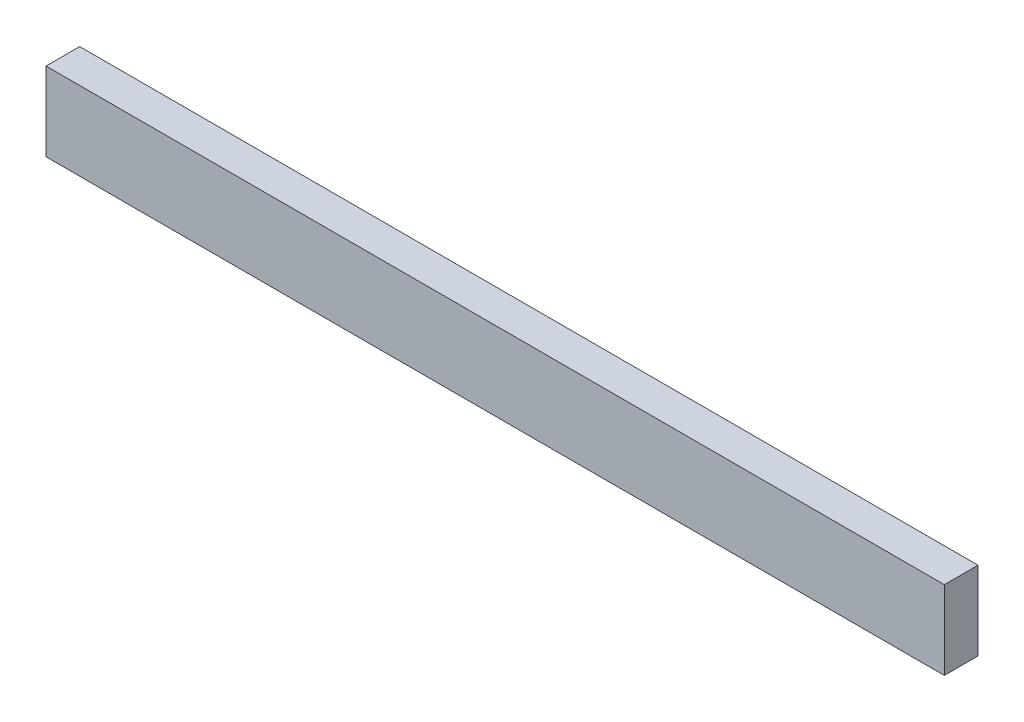
ISO-10303-21;
HEADER;
FILE_DESCRIPTION(('STEP AP214'),'2;1');
FILE_NAME('part.step','',(''),(''),'','','');
FILE_SCHEMA(('AUTOMOTIVE_DESIGN { 1 0 10303 214 1 1 1 1 }'));
ENDSEC;
DATA;
#1=APPLICATION_CONTEXT('core data for automotive mechanical design processes');
#2=APPLICATION_PROTOCOL_DEFINITION('international standard','automotive_design',2000,#1);
#3=PRODUCT_CONTEXT('',#1,'mechanical');
#4=PRODUCT('Part','Part','',(#3));
#5=PRODUCT_RELATED_PRODUCT_CATEGORY('part','',(#4));
#6=PRODUCT_DEFINITION_FORMATION('','',#4);
#7=PRODUCT_DEFINITION_CONTEXT('part definition',#1,'design');
#8=PRODUCT_DEFINITION('design','',#6,#7);
#9=PRODUCT_DEFINITION_SHAPE('','',#8);
#10=(LENGTH_UNIT() NAMED_UNIT(*) SI_UNIT(.MILLI.,.METRE.));
#11=(NAMED_UNIT(*) PLANE_ANGLE_UNIT() SI_UNIT($,.RADIAN.));
#12=(NAMED_UNIT(*) SI_UNIT($,.STERADIAN.) SOLID_ANGLE_UNIT());
#13=UNCERTAINTY_MEASURE_WITH_UNIT(LENGTH_MEASURE(1.E-05),#10,'distance_accuracy_value','');
#14=(GEOMETRIC_REPRESENTATION_CONTEXT(3) GLOBAL_UNCERTAINTY_ASSIGNED_CONTEXT((#13)) GLOBAL_UNIT_ASSIGNED_CONTEXT((#10,
#11,#12)) REPRESENTATION_CONTEXT('',''));
#15=CARTESIAN_POINT('',(0.,0.,0.));
#16=DIRECTION('',(0.,0.,1.));
#17=DIRECTION('',(1.,0.,0.));
#18=AXIS2_PLACEMENT_3D('',#15,#16,#17);
#19=CARTESIAN_POINT('',(-508.,-88.9,-134.9375));
#20=DIRECTION('',(1.,0.,0.));
#21=DIRECTION('',(0.,0.,-1.));
#22=AXIS2_PLACEMENT_3D('',#19,#20,#21);
#23=PLANE('',#22);
#24=DIRECTION('',(0.,0.,-1.));
#25=VECTOR('',#24,1.);
#26=CARTESIAN_POINT('',(-508.,0.,-134.9375));
#27=LINE('',#26,#25);
#28=CARTESIAN_POINT('',(-508.,0.,-134.9375));
#29=VERTEX_POINT('',#28);
#30=CARTESIAN_POINT('',(-508.,0.,-173.0375));
#31=VERTEX_POINT('',#30);
#32=EDGE_CURVE('E99',#29,#31,#27,.T.);
#33=ORIENTED_EDGE('',*,*,#32,.T.);
#34=DIRECTION('',(0.,1.,0.));
#35=VECTOR('',#34,1.);
#36=CARTESIAN_POINT('',(-508.,-88.9,-173.0375));
#37=LINE('',#36,#35);
#38=CARTESIAN_POINT('',(-508.,-88.9,-173.0375));
#39=VERTEX_POINT('',#38);
#40=EDGE_CURVE('E11',#39,#31,#37,.T.);
#41=ORIENTED_EDGE('',*,*,#40,.F.);
#42=DIRECTION('',(0.,0.,-1.));
#43=VECTOR('',#42,1.);
#44=CARTESIAN_POINT('',(-508.,-88.9,-134.9375));
#45=LINE('',#44,#43);
#46=CARTESIAN_POINT('',(-508.,-88.9,-134.9375));
#47=VERTEX_POINT('',#46);
#48=EDGE_CURVE('E87',#47,#39,#45,.T.);
#49=ORIENTED_EDGE('',*,*,#48,.F.);
#50=DIRECTION('',(0.,1.,0.));
#51=VECTOR('',#50,1.);
#52=CARTESIAN_POINT('',(-508.,-88.9,-134.9375));
#53=LINE('',#52,#51);
#54=EDGE_CURVE('E95',#47,#29,#53,.T.);
#55=ORIENTED_EDGE('',*,*,#54,.T.);
#56=EDGE_LOOP('',(#33,#41,#49,#55));
#57=FACE_BOUND('',#56,.T.);
#58=ADVANCED_FACE('F36',(#57),#23,.F.);
#59=CARTESIAN_POINT('',(-508.,-88.9,-173.0375));
#60=DIRECTION('',(0.,0.,1.));
#61=DIRECTION('',(1.,0.,0.));
#62=AXIS2_PLACEMENT_3D('',#59,#60,#61);
#63=PLANE('',#62);
#64=DIRECTION('',(1.,0.,0.));
#65=VECTOR('',#64,1.);
#66=CARTESIAN_POINT('',(-508.,0.,-173.0375));
#67=LINE('',#66,#65);
#68=CARTESIAN_POINT('',(508.,0.,-173.0375));
#69=VERTEX_POINT('',#68);
#70=EDGE_CURVE('E91',#31,#69,#67,.T.);
#71=ORIENTED_EDGE('',*,*,#70,.T.);
#72=DIRECTION('',(0.,1.,0.));
#73=VECTOR('',#72,1.);
#74=CARTESIAN_POINT('',(508.,-88.9,-173.0375));
#75=LINE('',#74,#73);
#76=CARTESIAN_POINT('',(508.,-88.9,-173.0375));
#77=VERTEX_POINT('',#76);
#78=EDGE_CURVE('E44',#77,#69,#75,.T.);
#79=ORIENTED_EDGE('',*,*,#78,.F.);
#80=DIRECTION('',(1.,0.,0.));
#81=VECTOR('',#80,1.);
#82=CARTESIAN_POINT('',(-508.,-88.9,-173.0375));
#83=LINE('',#82,#81);
#84=EDGE_CURVE('E82',#39,#77,#83,.T.);
#85=ORIENTED_EDGE('',*,*,#84,.F.);
#86=ORIENTED_EDGE('',*,*,#40,.T.);
#87=EDGE_LOOP('',(#71,#79,#85,#86));
#88=FACE_BOUND('',#87,.T.);
#89=ADVANCED_FACE('F90',(#88),#63,.F.);
#90=CARTESIAN_POINT('',(508.,-88.9,-134.9375));
#91=DIRECTION('',(-1.,0.,0.));
#92=DIRECTION('',(0.,0.,1.));
#93=AXIS2_PLACEMENT_3D('',#90,#91,#92);
#94=PLANE('',#93);
#95=DIRECTION('',(0.,0.,1.));
#96=VECTOR('',#95,1.);
#97=CARTESIAN_POINT('',(508.,0.,-134.9375));
#98=LINE('',#97,#96);
#99=CARTESIAN_POINT('',(508.,0.,-134.9375));
#100=VERTEX_POINT('',#99);
#101=EDGE_CURVE('E69',#69,#100,#98,.T.);
#102=ORIENTED_EDGE('',*,*,#101,.T.);
#103=DIRECTION('',(0.,1.,0.));
#104=VECTOR('',#103,1.);
#105=CARTESIAN_POINT('',(508.,-88.9,-134.9375));
#106=LINE('',#105,#104);
#107=CARTESIAN_POINT('',(508.,-88.9,-134.9375));
#108=VERTEX_POINT('',#107);
#109=EDGE_CURVE('E92',#108,#100,#106,.T.);
#110=ORIENTED_EDGE('',*,*,#109,.F.);
#111=DIRECTION('',(0.,0.,1.));
#112=VECTOR('',#111,1.);
#113=CARTESIAN_POINT('',(508.,-88.9,-134.9375));
#114=LINE('',#113,#112);
#115=EDGE_CURVE('E85',#77,#108,#114,.T.);
#116=ORIENTED_EDGE('',*,*,#115,.F.);
#117=ORIENTED_EDGE('',*,*,#78,.T.);
#118=EDGE_LOOP('',(#102,#110,#116,#117));
#119=FACE_BOUND('',#118,.T.);
#120=ADVANCED_FACE('F93',(#119),#94,.F.);
#121=CARTESIAN_POINT('',(-508.,-88.9,-134.9375));
#122=DIRECTION('',(0.,0.,-1.));
#123=DIRECTION('',(-1.,0.,0.));
#124=AXIS2_PLACEMENT_3D('',#121,#122,#123);
#125=PLANE('',#124);
#126=DIRECTION('',(-1.,0.,0.));
#127=VECTOR('',#126,1.);
#128=CARTESIAN_POINT('',(-508.,0.,-134.9375));
#129=LINE('',#128,#127);
#130=EDGE_CURVE('E75',#100,#29,#129,.T.);
#131=ORIENTED_EDGE('',*,*,#130,.T.);
#132=ORIENTED_EDGE('',*,*,#54,.F.);
#133=DIRECTION('',(-1.,0.,0.));
#134=VECTOR('',#133,1.);
#135=CARTESIAN_POINT('',(-508.,-88.9,-134.9375));
#136=LINE('',#135,#134);
#137=EDGE_CURVE('E52',#108,#47,#136,.T.);
#138=ORIENTED_EDGE('',*,*,#137,.F.);
#139=ORIENTED_EDGE('',*,*,#109,.T.);
#140=EDGE_LOOP('',(#131,#132,#138,#139));
#141=FACE_BOUND('',#140,.T.);
#142=ADVANCED_FACE('F106',(#141),#125,.F.);
#143=CARTESIAN_POINT('',(0.,-88.9,0.));
#144=DIRECTION('',(0.,-1.,0.));
#145=DIRECTION('',(0.,0.,-1.));
#146=AXIS2_PLACEMENT_3D('',#143,#144,#145);
#147=PLANE('',#146);
#148=ORIENTED_EDGE('',*,*,#48,.T.);
#149=ORIENTED_EDGE('',*,*,#84,.T.);
#150=ORIENTED_EDGE('',*,*,#115,.T.);
#151=ORIENTED_EDGE('',*,*,#137,.T.);
#152=EDGE_LOOP('',(#148,#149,#150,#151));
#153=FACE_BOUND('',#152,.T.);
#154=ADVANCED_FACE('F83',(#153),#147,.T.);
#155=CARTESIAN_POINT('',(0.,0.,0.));
#156=DIRECTION('',(0.,-1.,0.));
#157=DIRECTION('',(0.,0.,-1.));
#158=AXIS2_PLACEMENT_3D('',#155,#156,#157);
#159=PLANE('',#158);
#160=ORIENTED_EDGE('',*,*,#32,.F.);
#161=ORIENTED_EDGE('',*,*,#130,.F.);
#162=ORIENTED_EDGE('',*,*,#101,.F.);
#163=ORIENTED_EDGE('',*,*,#70,.F.);
#164=EDGE_LOOP('',(#160,#161,#162,#163));
#165=FACE_BOUND('',#164,.T.);
#166=ADVANCED_FACE('F109',(#165),#159,.F.);
#167=CLOSED_SHELL('',(#58,#89,#120,#142,#154,#166));
#168=MANIFOLD_SOLID_BREP('B2',#167);
#169=ADVANCED_BREP_SHAPE_REPRESENTATION('',(#18,#168),#14);
#170=SHAPE_DEFINITION_REPRESENTATION(#9,#169);
ENDSEC;
END-ISO-10303-21;
